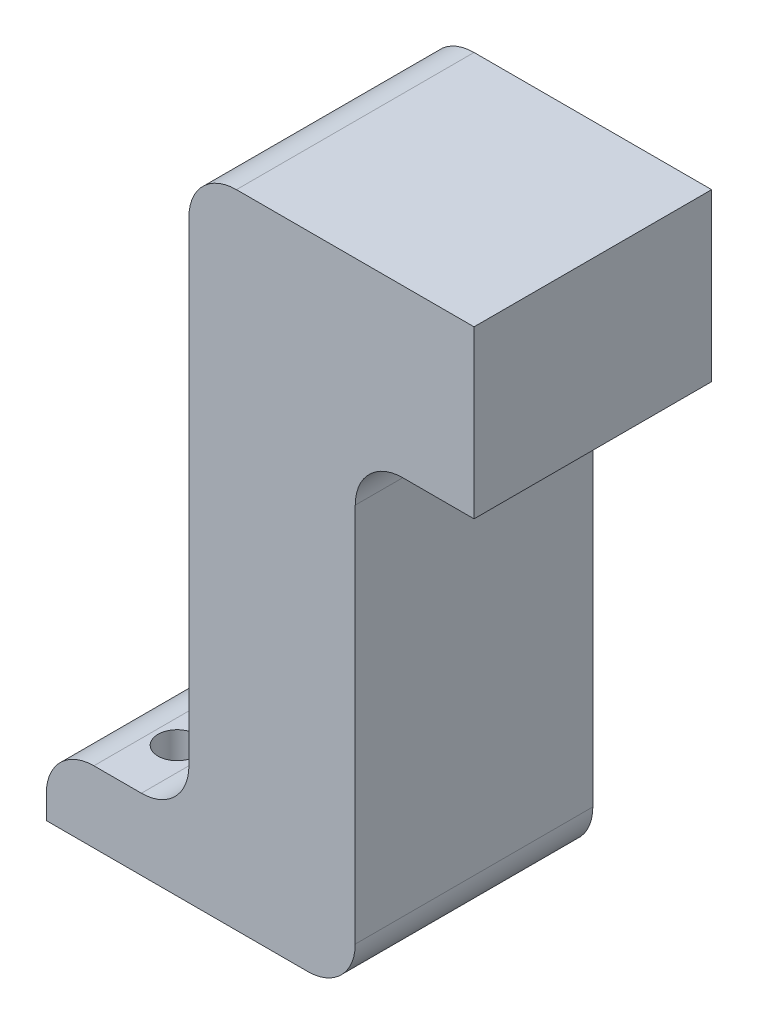
ISO-10303-21;
HEADER;
FILE_DESCRIPTION(('STEP AP214'),'2;1');
FILE_NAME('part.step','',(''),(''),'','','');
FILE_SCHEMA(('AUTOMOTIVE_DESIGN { 1 0 10303 214 1 1 1 1 }'));
ENDSEC;
DATA;
#1=APPLICATION_CONTEXT('core data for automotive mechanical design processes');
#2=APPLICATION_PROTOCOL_DEFINITION('international standard','automotive_design',2000,#1);
#3=PRODUCT_CONTEXT('',#1,'mechanical');
#4=PRODUCT('Part','Part','',(#3));
#5=PRODUCT_RELATED_PRODUCT_CATEGORY('part','',(#4));
#6=PRODUCT_DEFINITION_FORMATION('','',#4);
#7=PRODUCT_DEFINITION_CONTEXT('part definition',#1,'design');
#8=PRODUCT_DEFINITION('design','',#6,#7);
#9=PRODUCT_DEFINITION_SHAPE('','',#8);
#10=(LENGTH_UNIT() NAMED_UNIT(*) SI_UNIT(.MILLI.,.METRE.));
#11=(NAMED_UNIT(*) PLANE_ANGLE_UNIT() SI_UNIT($,.RADIAN.));
#12=(NAMED_UNIT(*) SI_UNIT($,.STERADIAN.) SOLID_ANGLE_UNIT());
#13=UNCERTAINTY_MEASURE_WITH_UNIT(LENGTH_MEASURE(1.E-05),#10,'distance_accuracy_value','');
#14=(GEOMETRIC_REPRESENTATION_CONTEXT(3) GLOBAL_UNCERTAINTY_ASSIGNED_CONTEXT((#13)) GLOBAL_UNIT_ASSIGNED_CONTEXT((#10,
#11,#12)) REPRESENTATION_CONTEXT('',''));
#15=CARTESIAN_POINT('',(0.,0.,0.));
#16=DIRECTION('',(0.,0.,1.));
#17=DIRECTION('',(1.,0.,0.));
#18=AXIS2_PLACEMENT_3D('',#15,#16,#17);
#19=CARTESIAN_POINT('',(0.,2.,-0.625));
#20=DIRECTION('',(0.,-1.,0.));
#21=DIRECTION('',(0.,0.,-1.));
#22=AXIS2_PLACEMENT_3D('',#19,#20,#21);
#23=PLANE('',#22);
#24=DIRECTION('',(1.,0.,0.));
#25=VECTOR('',#24,1.);
#26=CARTESIAN_POINT('',(0.,2.,-0.625));
#27=LINE('',#26,#25);
#28=CARTESIAN_POINT('',(-0.964230564727712,2.,-0.625));
#29=VERTEX_POINT('',#28);
#30=CARTESIAN_POINT('',(1.53576943527229,2.,-0.625));
#31=VERTEX_POINT('',#30);
#32=EDGE_CURVE('E221',#29,#31,#27,.T.);
#33=ORIENTED_EDGE('',*,*,#32,.F.);
#34=DIRECTION('',(0.,0.,1.));
#35=VECTOR('',#34,1.);
#36=CARTESIAN_POINT('',(-0.964230564727712,2.,-0.625));
#37=LINE('',#36,#35);
#38=CARTESIAN_POINT('',(-0.964230564727712,2.,1.875));
#39=VERTEX_POINT('',#38);
#40=EDGE_CURVE('E280',#29,#39,#37,.T.);
#41=ORIENTED_EDGE('',*,*,#40,.T.);
#42=DIRECTION('',(1.,0.,0.));
#43=VECTOR('',#42,1.);
#44=CARTESIAN_POINT('',(0.,2.,1.875));
#45=LINE('',#44,#43);
#46=CARTESIAN_POINT('',(1.53576943527229,2.,1.875));
#47=VERTEX_POINT('',#46);
#48=EDGE_CURVE('E211',#39,#47,#45,.T.);
#49=ORIENTED_EDGE('',*,*,#48,.T.);
#50=DIRECTION('',(0.,0.,1.));
#51=VECTOR('',#50,1.);
#52=CARTESIAN_POINT('',(1.53576943527229,2.,-0.625));
#53=LINE('',#52,#51);
#54=EDGE_CURVE('E205',#31,#47,#53,.T.);
#55=ORIENTED_EDGE('',*,*,#54,.F.);
#56=EDGE_LOOP('',(#33,#41,#49,#55));
#57=FACE_BOUND('',#56,.T.);
#58=ADVANCED_FACE('F87',(#57),#23,.F.);
#59=CARTESIAN_POINT('',(-1.46423056472771,0.,-0.625));
#60=DIRECTION('',(1.,0.,0.));
#61=DIRECTION('',(0.,1.,0.));
#62=AXIS2_PLACEMENT_3D('',#59,#60,#61);
#63=PLANE('',#62);
#64=DIRECTION('',(0.,1.,0.));
#65=VECTOR('',#64,1.);
#66=CARTESIAN_POINT('',(-1.46423056472771,0.,-0.625));
#67=LINE('',#66,#65);
#68=CARTESIAN_POINT('',(-1.46423056472771,-3.5,-0.625));
#69=VERTEX_POINT('',#68);
#70=CARTESIAN_POINT('',(-1.46423056472771,1.5,-0.625));
#71=VERTEX_POINT('',#70);
#72=EDGE_CURVE('E206',#69,#71,#67,.T.);
#73=ORIENTED_EDGE('',*,*,#72,.F.);
#74=DIRECTION('',(0.,0.,1.));
#75=VECTOR('',#74,1.);
#76=CARTESIAN_POINT('',(-1.46423056472771,-3.5,-0.625));
#77=LINE('',#76,#75);
#78=CARTESIAN_POINT('',(-1.46423056472771,-3.5,1.875));
#79=VERTEX_POINT('',#78);
#80=EDGE_CURVE('E275',#69,#79,#77,.T.);
#81=ORIENTED_EDGE('',*,*,#80,.T.);
#82=DIRECTION('',(0.,1.,0.));
#83=VECTOR('',#82,1.);
#84=CARTESIAN_POINT('',(-1.46423056472771,0.,1.875));
#85=LINE('',#84,#83);
#86=CARTESIAN_POINT('',(-1.46423056472771,1.5,1.875));
#87=VERTEX_POINT('',#86);
#88=EDGE_CURVE('E213',#79,#87,#85,.T.);
#89=ORIENTED_EDGE('',*,*,#88,.T.);
#90=DIRECTION('',(0.,0.,1.));
#91=VECTOR('',#90,1.);
#92=CARTESIAN_POINT('',(-1.46423056472771,1.5,-0.625));
#93=LINE('',#92,#91);
#94=EDGE_CURVE('E110',#87,#71,#93,.F.);
#95=ORIENTED_EDGE('',*,*,#94,.T.);
#96=EDGE_LOOP('',(#73,#81,#89,#95));
#97=FACE_BOUND('',#96,.T.);
#98=ADVANCED_FACE('F306',(#97),#63,.F.);
#99=CARTESIAN_POINT('',(1.53576943527229,0.,-0.625));
#100=DIRECTION('',(1.,0.,0.));
#101=DIRECTION('',(0.,0.,-1.));
#102=AXIS2_PLACEMENT_3D('',#99,#100,#101);
#103=PLANE('',#102);
#104=ORIENTED_EDGE('',*,*,#54,.T.);
#105=DIRECTION('',(0.,1.,0.));
#106=VECTOR('',#105,1.);
#107=CARTESIAN_POINT('',(1.53576943527229,0.,1.875));
#108=LINE('',#107,#106);
#109=CARTESIAN_POINT('',(1.53576943527229,0.25,1.875));
#110=VERTEX_POINT('',#109);
#111=EDGE_CURVE('E189',#110,#47,#108,.T.);
#112=ORIENTED_EDGE('',*,*,#111,.F.);
#113=DIRECTION('',(0.,0.,1.));
#114=VECTOR('',#113,1.);
#115=CARTESIAN_POINT('',(1.53576943527229,0.25,-0.625));
#116=LINE('',#115,#114);
#117=CARTESIAN_POINT('',(1.53576943527229,0.25,-0.625));
#118=VERTEX_POINT('',#117);
#119=EDGE_CURVE('E198',#118,#110,#116,.T.);
#120=ORIENTED_EDGE('',*,*,#119,.F.);
#121=DIRECTION('',(0.,1.,0.));
#122=VECTOR('',#121,1.);
#123=CARTESIAN_POINT('',(1.53576943527229,0.,-0.625));
#124=LINE('',#123,#122);
#125=EDGE_CURVE('E219',#118,#31,#124,.T.);
#126=ORIENTED_EDGE('',*,*,#125,.T.);
#127=EDGE_LOOP('',(#104,#112,#120,#126));
#128=FACE_BOUND('',#127,.T.);
#129=ADVANCED_FACE('F209',(#128),#103,.T.);
#130=CARTESIAN_POINT('',(0.,0.,-0.625));
#131=DIRECTION('',(0.,0.,1.));
#132=DIRECTION('',(1.,0.,0.));
#133=AXIS2_PLACEMENT_3D('',#130,#131,#132);
#134=PLANE('',#133);
#135=DIRECTION('',(0.,1.,0.));
#136=VECTOR('',#135,1.);
#137=CARTESIAN_POINT('',(-2.96423056472771,0.,-0.625));
#138=LINE('',#137,#136);
#139=CARTESIAN_POINT('',(-2.96423056472771,-4.75,-0.625));
#140=VERTEX_POINT('',#139);
#141=CARTESIAN_POINT('',(-2.96423056472771,-4.5,-0.625));
#142=VERTEX_POINT('',#141);
#143=EDGE_CURVE('E240',#140,#142,#138,.T.);
#144=ORIENTED_EDGE('',*,*,#143,.T.);
#145=CARTESIAN_POINT('',(-2.46423056472771,-4.5,-0.625));
#146=DIRECTION('',(0.,0.,1.));
#147=DIRECTION('',(1.,0.,0.));
#148=AXIS2_PLACEMENT_3D('',#145,#146,#147);
#149=CIRCLE('',#148,0.5);
#150=CARTESIAN_POINT('',(-2.46423056472771,-4.,-0.625));
#151=VERTEX_POINT('',#150);
#152=EDGE_CURVE('E265',#142,#151,#149,.F.);
#153=ORIENTED_EDGE('',*,*,#152,.T.);
#154=DIRECTION('',(-1.,0.,0.));
#155=VECTOR('',#154,1.);
#156=CARTESIAN_POINT('',(0.,-4.,-0.625));
#157=LINE('',#156,#155);
#158=CARTESIAN_POINT('',(-1.96423056472771,-4.,-0.625));
#159=VERTEX_POINT('',#158);
#160=EDGE_CURVE('E245',#159,#151,#157,.T.);
#161=ORIENTED_EDGE('',*,*,#160,.F.);
#162=CARTESIAN_POINT('',(-1.96423056472771,-3.5,-0.625));
#163=DIRECTION('',(0.,0.,1.));
#164=DIRECTION('',(1.,0.,0.));
#165=AXIS2_PLACEMENT_3D('',#162,#163,#164);
#166=CIRCLE('',#165,0.5);
#167=EDGE_CURVE('E285',#159,#69,#166,.T.);
#168=ORIENTED_EDGE('',*,*,#167,.T.);
#169=ORIENTED_EDGE('',*,*,#72,.T.);
#170=CARTESIAN_POINT('',(-0.964230564727712,1.5,-0.625));
#171=DIRECTION('',(0.,0.,1.));
#172=DIRECTION('',(1.,0.,0.));
#173=AXIS2_PLACEMENT_3D('',#170,#171,#172);
#174=CIRCLE('',#173,0.5);
#175=EDGE_CURVE('E102',#71,#29,#174,.F.);
#176=ORIENTED_EDGE('',*,*,#175,.T.);
#177=ORIENTED_EDGE('',*,*,#32,.T.);
#178=ORIENTED_EDGE('',*,*,#125,.F.);
#179=DIRECTION('',(1.,0.,0.));
#180=VECTOR('',#179,1.);
#181=CARTESIAN_POINT('',(0.,0.25,-0.625));
#182=LINE('',#181,#180);
#183=CARTESIAN_POINT('',(0.785769435272288,0.25,-0.625));
#184=VERTEX_POINT('',#183);
#185=EDGE_CURVE('E201',#184,#118,#182,.T.);
#186=ORIENTED_EDGE('',*,*,#185,.F.);
#187=CARTESIAN_POINT('',(0.785769435272288,-0.25,-0.625));
#188=DIRECTION('',(0.,0.,1.));
#189=DIRECTION('',(1.,0.,0.));
#190=AXIS2_PLACEMENT_3D('',#187,#188,#189);
#191=CIRCLE('',#190,0.5);
#192=CARTESIAN_POINT('',(0.285769435272288,-0.25,-0.625));
#193=VERTEX_POINT('',#192);
#194=EDGE_CURVE('E95',#184,#193,#191,.T.);
#195=ORIENTED_EDGE('',*,*,#194,.T.);
#196=DIRECTION('',(0.,-1.,0.));
#197=VECTOR('',#196,1.);
#198=CARTESIAN_POINT('',(0.285769435272288,0.25,-0.625));
#199=LINE('',#198,#197);
#200=CARTESIAN_POINT('',(0.285769435272291,-4.25,-0.625));
#201=VERTEX_POINT('',#200);
#202=EDGE_CURVE('E226',#193,#201,#199,.T.);
#203=ORIENTED_EDGE('',*,*,#202,.T.);
#204=CARTESIAN_POINT('',(-0.214230564727709,-4.25,-0.625));
#205=DIRECTION('',(0.,0.,1.));
#206=DIRECTION('',(1.,0.,0.));
#207=AXIS2_PLACEMENT_3D('',#204,#205,#206);
#208=CIRCLE('',#207,0.5);
#209=CARTESIAN_POINT('',(-0.214230564727709,-4.75,-0.625));
#210=VERTEX_POINT('',#209);
#211=EDGE_CURVE('E263',#201,#210,#208,.F.);
#212=ORIENTED_EDGE('',*,*,#211,.T.);
#213=DIRECTION('',(-1.,0.,0.));
#214=VECTOR('',#213,1.);
#215=CARTESIAN_POINT('',(0.,-4.75,-0.625));
#216=LINE('',#215,#214);
#217=EDGE_CURVE('E243',#210,#140,#216,.T.);
#218=ORIENTED_EDGE('',*,*,#217,.T.);
#219=EDGE_LOOP('',(#144,#153,#161,#168,#169,#176,#177,#178,#186,#195,#203,#212,#218));
#220=FACE_BOUND('',#219,.T.);
#221=ADVANCED_FACE('F287',(#220),#134,.F.);
#222=CARTESIAN_POINT('',(0.,0.,1.875));
#223=DIRECTION('',(0.,0.,1.));
#224=DIRECTION('',(1.,0.,0.));
#225=AXIS2_PLACEMENT_3D('',#222,#223,#224);
#226=PLANE('',#225);
#227=DIRECTION('',(-1.,0.,0.));
#228=VECTOR('',#227,1.);
#229=CARTESIAN_POINT('',(0.,-4.,1.875));
#230=LINE('',#229,#228);
#231=CARTESIAN_POINT('',(-1.96423056472771,-4.,1.875));
#232=VERTEX_POINT('',#231);
#233=CARTESIAN_POINT('',(-2.46423056472771,-4.,1.875));
#234=VERTEX_POINT('',#233);
#235=EDGE_CURVE('E238',#232,#234,#230,.T.);
#236=ORIENTED_EDGE('',*,*,#235,.T.);
#237=CARTESIAN_POINT('',(-2.46423056472771,-4.5,1.875));
#238=DIRECTION('',(0.,0.,1.));
#239=DIRECTION('',(1.,0.,0.));
#240=AXIS2_PLACEMENT_3D('',#237,#238,#239);
#241=CIRCLE('',#240,0.5);
#242=CARTESIAN_POINT('',(-2.96423056472771,-4.5,1.875));
#243=VERTEX_POINT('',#242);
#244=EDGE_CURVE('E258',#234,#243,#241,.T.);
#245=ORIENTED_EDGE('',*,*,#244,.T.);
#246=DIRECTION('',(0.,1.,0.));
#247=VECTOR('',#246,1.);
#248=CARTESIAN_POINT('',(-2.96423056472771,0.,1.875));
#249=LINE('',#248,#247);
#250=CARTESIAN_POINT('',(-2.96423056472771,-4.75,1.875));
#251=VERTEX_POINT('',#250);
#252=EDGE_CURVE('E233',#251,#243,#249,.T.);
#253=ORIENTED_EDGE('',*,*,#252,.F.);
#254=DIRECTION('',(-1.,0.,0.));
#255=VECTOR('',#254,1.);
#256=CARTESIAN_POINT('',(0.,-4.75,1.875));
#257=LINE('',#256,#255);
#258=CARTESIAN_POINT('',(-0.214230564727709,-4.75,1.875));
#259=VERTEX_POINT('',#258);
#260=EDGE_CURVE('E236',#259,#251,#257,.T.);
#261=ORIENTED_EDGE('',*,*,#260,.F.);
#262=CARTESIAN_POINT('',(-0.214230564727709,-4.25,1.875));
#263=DIRECTION('',(0.,0.,1.));
#264=DIRECTION('',(1.,0.,0.));
#265=AXIS2_PLACEMENT_3D('',#262,#263,#264);
#266=CIRCLE('',#265,0.5);
#267=CARTESIAN_POINT('',(0.285769435272291,-4.25,1.875));
#268=VERTEX_POINT('',#267);
#269=EDGE_CURVE('E256',#259,#268,#266,.T.);
#270=ORIENTED_EDGE('',*,*,#269,.T.);
#271=DIRECTION('',(0.,-1.,0.));
#272=VECTOR('',#271,1.);
#273=CARTESIAN_POINT('',(0.285769435272288,0.25,1.875));
#274=LINE('',#273,#272);
#275=CARTESIAN_POINT('',(0.285769435272288,-0.25,1.875));
#276=VERTEX_POINT('',#275);
#277=EDGE_CURVE('E229',#276,#268,#274,.T.);
#278=ORIENTED_EDGE('',*,*,#277,.F.);
#279=CARTESIAN_POINT('',(0.785769435272288,-0.25,1.875));
#280=DIRECTION('',(0.,0.,1.));
#281=DIRECTION('',(1.,0.,0.));
#282=AXIS2_PLACEMENT_3D('',#279,#280,#281);
#283=CIRCLE('',#282,0.5);
#284=CARTESIAN_POINT('',(0.785769435272288,0.25,1.875));
#285=VERTEX_POINT('',#284);
#286=EDGE_CURVE('E12',#276,#285,#283,.F.);
#287=ORIENTED_EDGE('',*,*,#286,.T.);
#288=DIRECTION('',(1.,0.,0.));
#289=VECTOR('',#288,1.);
#290=CARTESIAN_POINT('',(0.,0.25,1.875));
#291=LINE('',#290,#289);
#292=EDGE_CURVE('E183',#285,#110,#291,.T.);
#293=ORIENTED_EDGE('',*,*,#292,.T.);
#294=ORIENTED_EDGE('',*,*,#111,.T.);
#295=ORIENTED_EDGE('',*,*,#48,.F.);
#296=CARTESIAN_POINT('',(-0.964230564727712,1.5,1.875));
#297=DIRECTION('',(0.,0.,1.));
#298=DIRECTION('',(1.,0.,0.));
#299=AXIS2_PLACEMENT_3D('',#296,#297,#298);
#300=CIRCLE('',#299,0.5);
#301=EDGE_CURVE('E254',#39,#87,#300,.T.);
#302=ORIENTED_EDGE('',*,*,#301,.T.);
#303=ORIENTED_EDGE('',*,*,#88,.F.);
#304=CARTESIAN_POINT('',(-1.96423056472771,-3.5,1.875));
#305=DIRECTION('',(0.,0.,1.));
#306=DIRECTION('',(1.,0.,0.));
#307=AXIS2_PLACEMENT_3D('',#304,#305,#306);
#308=CIRCLE('',#307,0.5);
#309=EDGE_CURVE('E283',#79,#232,#308,.F.);
#310=ORIENTED_EDGE('',*,*,#309,.T.);
#311=EDGE_LOOP('',(#236,#245,#253,#261,#270,#278,#287,#293,#294,#295,#302,#303,#310));
#312=FACE_BOUND('',#311,.T.);
#313=ADVANCED_FACE('F186',(#312),#226,.T.);
#314=CARTESIAN_POINT('',(0.,0.25,-0.625));
#315=DIRECTION('',(0.,-1.,0.));
#316=DIRECTION('',(0.,0.,-1.));
#317=AXIS2_PLACEMENT_3D('',#314,#315,#316);
#318=PLANE('',#317);
#319=ORIENTED_EDGE('',*,*,#292,.F.);
#320=DIRECTION('',(0.,0.,-1.));
#321=VECTOR('',#320,1.);
#322=CARTESIAN_POINT('',(0.785769435272288,0.25,-0.625));
#323=LINE('',#322,#321);
#324=EDGE_CURVE('E278',#285,#184,#323,.T.);
#325=ORIENTED_EDGE('',*,*,#324,.T.);
#326=ORIENTED_EDGE('',*,*,#185,.T.);
#327=ORIENTED_EDGE('',*,*,#119,.T.);
#328=EDGE_LOOP('',(#319,#325,#326,#327));
#329=FACE_BOUND('',#328,.T.);
#330=ADVANCED_FACE('F199',(#329),#318,.T.);
#331=CARTESIAN_POINT('',(0.,-4.,-0.625));
#332=DIRECTION('',(0.,1.,0.));
#333=DIRECTION('',(0.,0.,1.));
#334=AXIS2_PLACEMENT_3D('',#331,#332,#333);
#335=PLANE('',#334);
#336=CARTESIAN_POINT('',(-2.21423056472771,-4.,0.));
#337=DIRECTION('',(0.,1.,0.));
#338=DIRECTION('',(0.,0.,1.));
#339=AXIS2_PLACEMENT_3D('',#336,#337,#338);
#340=CIRCLE('',#339,0.2);
#341=CARTESIAN_POINT('',(-2.21423056472771,-4.,0.2));
#342=VERTEX_POINT('',#341);
#343=EDGE_CURVE('E481',#342,#342,#340,.T.);
#344=ORIENTED_EDGE('',*,*,#343,.F.);
#345=EDGE_LOOP('',(#344));
#346=FACE_BOUND('',#345,.T.);
#347=CARTESIAN_POINT('',(-2.21423056472771,-4.,1.25));
#348=DIRECTION('',(0.,1.,0.));
#349=DIRECTION('',(0.,0.,1.));
#350=AXIS2_PLACEMENT_3D('',#347,#348,#349);
#351=CIRCLE('',#350,0.2);
#352=CARTESIAN_POINT('',(-2.21423056472771,-4.,1.45));
#353=VERTEX_POINT('',#352);
#354=EDGE_CURVE('E483',#353,#353,#351,.T.);
#355=ORIENTED_EDGE('',*,*,#354,.F.);
#356=EDGE_LOOP('',(#355));
#357=FACE_BOUND('',#356,.T.);
#358=ORIENTED_EDGE('',*,*,#160,.T.);
#359=DIRECTION('',(0.,0.,1.));
#360=VECTOR('',#359,1.);
#361=CARTESIAN_POINT('',(-2.46423056472771,-4.,1.875));
#362=LINE('',#361,#360);
#363=EDGE_CURVE('E251',#151,#234,#362,.T.);
#364=ORIENTED_EDGE('',*,*,#363,.T.);
#365=ORIENTED_EDGE('',*,*,#235,.F.);
#366=DIRECTION('',(0.,0.,1.));
#367=VECTOR('',#366,1.);
#368=CARTESIAN_POINT('',(-1.96423056472771,-4.,-0.625));
#369=LINE('',#368,#367);
#370=EDGE_CURVE('E224',#232,#159,#369,.F.);
#371=ORIENTED_EDGE('',*,*,#370,.T.);
#372=EDGE_LOOP('',(#358,#364,#365,#371));
#373=FACE_BOUND('',#372,.T.);
#374=ADVANCED_FACE('F319',(#346,#357,#373),#335,.T.);
#375=CARTESIAN_POINT('',(-2.96423056472771,0.,-0.625));
#376=DIRECTION('',(1.,0.,0.));
#377=DIRECTION('',(0.,1.,0.));
#378=AXIS2_PLACEMENT_3D('',#375,#376,#377);
#379=PLANE('',#378);
#380=ORIENTED_EDGE('',*,*,#252,.T.);
#381=DIRECTION('',(0.,0.,1.));
#382=VECTOR('',#381,1.);
#383=CARTESIAN_POINT('',(-2.96423056472771,-4.5,-0.625));
#384=LINE('',#383,#382);
#385=EDGE_CURVE('E260',#243,#142,#384,.F.);
#386=ORIENTED_EDGE('',*,*,#385,.T.);
#387=ORIENTED_EDGE('',*,*,#143,.F.);
#388=DIRECTION('',(0.,0.,1.));
#389=VECTOR('',#388,1.);
#390=CARTESIAN_POINT('',(-2.96423056472771,-4.75,-0.625));
#391=LINE('',#390,#389);
#392=EDGE_CURVE('E195',#140,#251,#391,.T.);
#393=ORIENTED_EDGE('',*,*,#392,.T.);
#394=EDGE_LOOP('',(#380,#386,#387,#393));
#395=FACE_BOUND('',#394,.T.);
#396=ADVANCED_FACE('F324',(#395),#379,.F.);
#397=CARTESIAN_POINT('',(0.,-4.75,-0.625));
#398=DIRECTION('',(0.,1.,0.));
#399=DIRECTION('',(0.,0.,1.));
#400=AXIS2_PLACEMENT_3D('',#397,#398,#399);
#401=PLANE('',#400);
#402=CARTESIAN_POINT('',(-2.21423056472771,-4.75,0.));
#403=DIRECTION('',(0.,1.,0.));
#404=DIRECTION('',(0.,0.,1.));
#405=AXIS2_PLACEMENT_3D('',#402,#403,#404);
#406=CIRCLE('',#405,0.2);
#407=CARTESIAN_POINT('',(-2.21423056472771,-4.75,0.2));
#408=VERTEX_POINT('',#407);
#409=EDGE_CURVE('E478',#408,#408,#406,.T.);
#410=ORIENTED_EDGE('',*,*,#409,.T.);
#411=EDGE_LOOP('',(#410));
#412=FACE_BOUND('',#411,.T.);
#413=CARTESIAN_POINT('',(-2.21423056472771,-4.75,1.25));
#414=DIRECTION('',(0.,1.,0.));
#415=DIRECTION('',(0.,0.,1.));
#416=AXIS2_PLACEMENT_3D('',#413,#414,#415);
#417=CIRCLE('',#416,0.2);
#418=CARTESIAN_POINT('',(-2.21423056472771,-4.75,1.45));
#419=VERTEX_POINT('',#418);
#420=EDGE_CURVE('E230',#419,#419,#417,.T.);
#421=ORIENTED_EDGE('',*,*,#420,.T.);
#422=EDGE_LOOP('',(#421));
#423=FACE_BOUND('',#422,.T.);
#424=ORIENTED_EDGE('',*,*,#217,.F.);
#425=DIRECTION('',(0.,0.,-1.));
#426=VECTOR('',#425,1.);
#427=CARTESIAN_POINT('',(-0.214230564727709,-4.75,1.875));
#428=LINE('',#427,#426);
#429=EDGE_CURVE('E272',#210,#259,#428,.F.);
#430=ORIENTED_EDGE('',*,*,#429,.T.);
#431=ORIENTED_EDGE('',*,*,#260,.T.);
#432=ORIENTED_EDGE('',*,*,#392,.F.);
#433=EDGE_LOOP('',(#424,#430,#431,#432));
#434=FACE_BOUND('',#433,.T.);
#435=ADVANCED_FACE('F323',(#412,#423,#434),#401,.F.);
#436=CARTESIAN_POINT('',(0.285769435272288,0.25,1.875));
#437=DIRECTION('',(1.,0.,0.));
#438=DIRECTION('',(0.,1.,0.));
#439=AXIS2_PLACEMENT_3D('',#436,#437,#438);
#440=PLANE('',#439);
#441=ORIENTED_EDGE('',*,*,#277,.T.);
#442=DIRECTION('',(0.,0.,-1.));
#443=VECTOR('',#442,1.);
#444=CARTESIAN_POINT('',(0.285769435272291,-4.25,-0.625));
#445=LINE('',#444,#443);
#446=EDGE_CURVE('E269',#268,#201,#445,.T.);
#447=ORIENTED_EDGE('',*,*,#446,.T.);
#448=ORIENTED_EDGE('',*,*,#202,.F.);
#449=DIRECTION('',(0.,0.,-1.));
#450=VECTOR('',#449,1.);
#451=CARTESIAN_POINT('',(0.285769435272288,-0.25,1.875));
#452=LINE('',#451,#450);
#453=EDGE_CURVE('E267',#193,#276,#452,.F.);
#454=ORIENTED_EDGE('',*,*,#453,.T.);
#455=EDGE_LOOP('',(#441,#447,#448,#454));
#456=FACE_BOUND('',#455,.T.);
#457=ADVANCED_FACE('F291',(#456),#440,.T.);
#458=CARTESIAN_POINT('',(-2.46423056472771,-4.5,-0.625));
#459=DIRECTION('',(0.,0.,-1.));
#460=DIRECTION('',(-1.,0.,0.));
#461=AXIS2_PLACEMENT_3D('',#458,#459,#460);
#462=CYLINDRICAL_SURFACE('',#461,0.5);
#463=ORIENTED_EDGE('',*,*,#152,.F.);
#464=ORIENTED_EDGE('',*,*,#385,.F.);
#465=ORIENTED_EDGE('',*,*,#244,.F.);
#466=ORIENTED_EDGE('',*,*,#363,.F.);
#467=EDGE_LOOP('',(#463,#464,#465,#466));
#468=FACE_BOUND('',#467,.T.);
#469=ADVANCED_FACE('F322',(#468),#462,.T.);
#470=CARTESIAN_POINT('',(-0.214230564727709,-4.25,1.875));
#471=DIRECTION('',(0.,0.,1.));
#472=DIRECTION('',(1.,0.,0.));
#473=AXIS2_PLACEMENT_3D('',#470,#471,#472);
#474=CYLINDRICAL_SURFACE('',#473,0.5);
#475=ORIENTED_EDGE('',*,*,#269,.F.);
#476=ORIENTED_EDGE('',*,*,#429,.F.);
#477=ORIENTED_EDGE('',*,*,#211,.F.);
#478=ORIENTED_EDGE('',*,*,#446,.F.);
#479=EDGE_LOOP('',(#475,#476,#477,#478));
#480=FACE_BOUND('',#479,.T.);
#481=ADVANCED_FACE('F302',(#480),#474,.T.);
#482=CARTESIAN_POINT('',(-1.96423056472771,-3.5,-0.625));
#483=DIRECTION('',(0.,0.,1.));
#484=DIRECTION('',(1.,0.,0.));
#485=AXIS2_PLACEMENT_3D('',#482,#483,#484);
#486=CYLINDRICAL_SURFACE('',#485,0.5);
#487=ORIENTED_EDGE('',*,*,#167,.F.);
#488=ORIENTED_EDGE('',*,*,#370,.F.);
#489=ORIENTED_EDGE('',*,*,#309,.F.);
#490=ORIENTED_EDGE('',*,*,#80,.F.);
#491=EDGE_LOOP('',(#487,#488,#489,#490));
#492=FACE_BOUND('',#491,.T.);
#493=ADVANCED_FACE('F295',(#492),#486,.F.);
#494=CARTESIAN_POINT('',(0.785769435272288,-0.25,-0.625));
#495=DIRECTION('',(0.,0.,1.));
#496=DIRECTION('',(1.,0.,0.));
#497=AXIS2_PLACEMENT_3D('',#494,#495,#496);
#498=CYLINDRICAL_SURFACE('',#497,0.5);
#499=ORIENTED_EDGE('',*,*,#286,.F.);
#500=ORIENTED_EDGE('',*,*,#453,.F.);
#501=ORIENTED_EDGE('',*,*,#194,.F.);
#502=ORIENTED_EDGE('',*,*,#324,.F.);
#503=EDGE_LOOP('',(#499,#500,#501,#502));
#504=FACE_BOUND('',#503,.T.);
#505=ADVANCED_FACE('F293',(#504),#498,.F.);
#506=CARTESIAN_POINT('',(-0.964230564727712,1.5,-0.625));
#507=DIRECTION('',(0.,0.,1.));
#508=DIRECTION('',(1.,0.,0.));
#509=AXIS2_PLACEMENT_3D('',#506,#507,#508);
#510=CYLINDRICAL_SURFACE('',#509,0.5);
#511=ORIENTED_EDGE('',*,*,#175,.F.);
#512=ORIENTED_EDGE('',*,*,#94,.F.);
#513=ORIENTED_EDGE('',*,*,#301,.F.);
#514=ORIENTED_EDGE('',*,*,#40,.F.);
#515=EDGE_LOOP('',(#511,#512,#513,#514));
#516=FACE_BOUND('',#515,.T.);
#517=ADVANCED_FACE('F89',(#516),#510,.T.);
#518=CARTESIAN_POINT('',(-2.21423056472771,-4.,1.25));
#519=DIRECTION('',(0.,1.,0.));
#520=DIRECTION('',(0.,0.,1.));
#521=AXIS2_PLACEMENT_3D('',#518,#519,#520);
#522=CYLINDRICAL_SURFACE('',#521,0.2);
#523=ORIENTED_EDGE('',*,*,#420,.F.);
#524=EDGE_LOOP('',(#523));
#525=FACE_BOUND('',#524,.T.);
#526=ORIENTED_EDGE('',*,*,#354,.T.);
#527=EDGE_LOOP('',(#526));
#528=FACE_BOUND('',#527,.T.);
#529=ADVANCED_FACE('F300',(#525,#528),#522,.F.);
#530=CARTESIAN_POINT('',(-2.21423056472771,-4.,0.));
#531=DIRECTION('',(0.,1.,0.));
#532=DIRECTION('',(0.,0.,1.));
#533=AXIS2_PLACEMENT_3D('',#530,#531,#532);
#534=CYLINDRICAL_SURFACE('',#533,0.2);
#535=ORIENTED_EDGE('',*,*,#409,.F.);
#536=EDGE_LOOP('',(#535));
#537=FACE_BOUND('',#536,.T.);
#538=ORIENTED_EDGE('',*,*,#343,.T.);
#539=EDGE_LOOP('',(#538));
#540=FACE_BOUND('',#539,.T.);
#541=ADVANCED_FACE('F401',(#537,#540),#534,.F.);
#542=CLOSED_SHELL('',(#58,#98,#129,#221,#313,#330,#374,#396,#435,#457,#469,#481,#493,#505,#517,
#529,#541));
#543=MANIFOLD_SOLID_BREP('B2',#542);
#544=ADVANCED_BREP_SHAPE_REPRESENTATION('',(#18,#543),#14);
#545=SHAPE_DEFINITION_REPRESENTATION(#9,#544);
ENDSEC;
END-ISO-10303-21;
